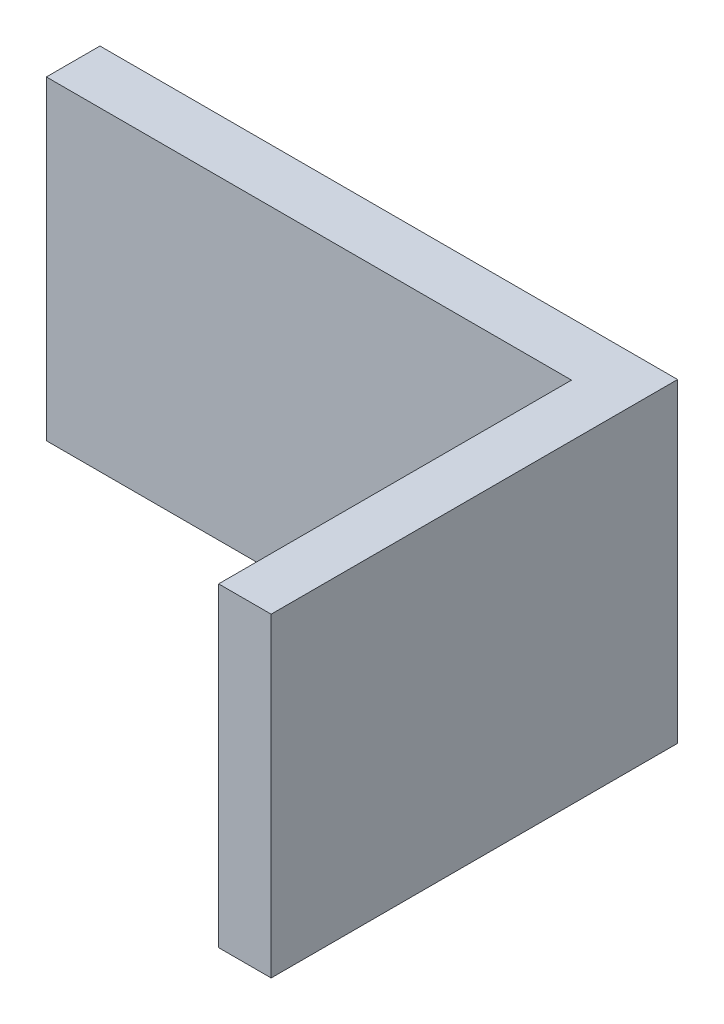
ISO-10303-21;
HEADER;
FILE_DESCRIPTION(('STEP AP214'),'2;1');
FILE_NAME('part.step','',(''),(''),'','','');
FILE_SCHEMA(('AUTOMOTIVE_DESIGN { 1 0 10303 214 1 1 1 1 }'));
ENDSEC;
DATA;
#1=APPLICATION_CONTEXT('core data for automotive mechanical design processes');
#2=APPLICATION_PROTOCOL_DEFINITION('international standard','automotive_design',2000,#1);
#3=PRODUCT_CONTEXT('',#1,'mechanical');
#4=PRODUCT('Part','Part','',(#3));
#5=PRODUCT_RELATED_PRODUCT_CATEGORY('part','',(#4));
#6=PRODUCT_DEFINITION_FORMATION('','',#4);
#7=PRODUCT_DEFINITION_CONTEXT('part definition',#1,'design');
#8=PRODUCT_DEFINITION('design','',#6,#7);
#9=PRODUCT_DEFINITION_SHAPE('','',#8);
#10=(LENGTH_UNIT() NAMED_UNIT(*) SI_UNIT(.MILLI.,.METRE.));
#11=(NAMED_UNIT(*) PLANE_ANGLE_UNIT() SI_UNIT($,.RADIAN.));
#12=(NAMED_UNIT(*) SI_UNIT($,.STERADIAN.) SOLID_ANGLE_UNIT());
#13=UNCERTAINTY_MEASURE_WITH_UNIT(LENGTH_MEASURE(1.E-05),#10,'distance_accuracy_value','');
#14=(GEOMETRIC_REPRESENTATION_CONTEXT(3) GLOBAL_UNCERTAINTY_ASSIGNED_CONTEXT((#13)) GLOBAL_UNIT_ASSIGNED_CONTEXT((#10,
#11,#12)) REPRESENTATION_CONTEXT('',''));
#15=CARTESIAN_POINT('',(0.,0.,0.));
#16=DIRECTION('',(0.,0.,1.));
#17=DIRECTION('',(1.,0.,0.));
#18=AXIS2_PLACEMENT_3D('',#15,#16,#17);
#19=CARTESIAN_POINT('',(4.55,2.9,0.));
#20=DIRECTION('',(0.,1.,0.));
#21=DIRECTION('',(0.,0.,1.));
#22=AXIS2_PLACEMENT_3D('',#19,#20,#21);
#23=PLANE('',#22);
#24=DIRECTION('',(1.,0.,0.));
#25=VECTOR('',#24,1.);
#26=CARTESIAN_POINT('',(4.,2.9,0.));
#27=LINE('',#26,#25);
#28=CARTESIAN_POINT('',(4.,2.9,0.));
#29=VERTEX_POINT('',#28);
#30=CARTESIAN_POINT('',(4.55,2.9,0.));
#31=VERTEX_POINT('',#30);
#32=EDGE_CURVE('E11',#29,#31,#27,.T.);
#33=ORIENTED_EDGE('',*,*,#32,.F.);
#34=DIRECTION('',(0.,0.,-1.));
#35=VECTOR('',#34,1.);
#36=CARTESIAN_POINT('',(4.,2.9,0.051));
#37=LINE('',#36,#35);
#38=CARTESIAN_POINT('',(4.,2.9,0.051));
#39=VERTEX_POINT('',#38);
#40=EDGE_CURVE('E24',#39,#29,#37,.T.);
#41=ORIENTED_EDGE('',*,*,#40,.F.);
#42=DIRECTION('',(-1.,0.,0.));
#43=VECTOR('',#42,1.);
#44=CARTESIAN_POINT('',(4.5,2.9,0.051));
#45=LINE('',#44,#43);
#46=CARTESIAN_POINT('',(4.5,2.9,0.051));
#47=VERTEX_POINT('',#46);
#48=EDGE_CURVE('E87',#47,#39,#45,.T.);
#49=ORIENTED_EDGE('',*,*,#48,.F.);
#50=DIRECTION('',(0.,0.,-1.));
#51=VECTOR('',#50,1.);
#52=CARTESIAN_POINT('',(4.5,2.9,0.387));
#53=LINE('',#52,#51);
#54=CARTESIAN_POINT('',(4.5,2.9,0.387));
#55=VERTEX_POINT('',#54);
#56=EDGE_CURVE('E114',#55,#47,#53,.T.);
#57=ORIENTED_EDGE('',*,*,#56,.F.);
#58=DIRECTION('',(-1.,0.,0.));
#59=VECTOR('',#58,1.);
#60=CARTESIAN_POINT('',(4.55,2.9,0.387));
#61=LINE('',#60,#59);
#62=CARTESIAN_POINT('',(4.55,2.9,0.387));
#63=VERTEX_POINT('',#62);
#64=EDGE_CURVE('E111',#63,#55,#61,.T.);
#65=ORIENTED_EDGE('',*,*,#64,.F.);
#66=DIRECTION('',(0.,0.,1.));
#67=VECTOR('',#66,1.);
#68=CARTESIAN_POINT('',(4.55,2.9,0.));
#69=LINE('',#68,#67);
#70=EDGE_CURVE('E108',#31,#63,#69,.T.);
#71=ORIENTED_EDGE('',*,*,#70,.F.);
#72=EDGE_LOOP('',(#33,#41,#49,#57,#65,#71));
#73=FACE_BOUND('',#72,.T.);
#74=ADVANCED_FACE('F17',(#73),#23,.T.);
#75=CARTESIAN_POINT('',(4.,2.6,0.));
#76=DIRECTION('',(0.,-1.,0.));
#77=DIRECTION('',(0.,0.,1.));
#78=AXIS2_PLACEMENT_3D('',#75,#76,#77);
#79=PLANE('',#78);
#80=DIRECTION('',(-1.,0.,0.));
#81=VECTOR('',#80,1.);
#82=CARTESIAN_POINT('',(4.55,2.6,0.));
#83=LINE('',#82,#81);
#84=CARTESIAN_POINT('',(4.55,2.6,0.));
#85=VERTEX_POINT('',#84);
#86=CARTESIAN_POINT('',(4.,2.6,0.));
#87=VERTEX_POINT('',#86);
#88=EDGE_CURVE('E106',#85,#87,#83,.T.);
#89=ORIENTED_EDGE('',*,*,#88,.F.);
#90=DIRECTION('',(0.,0.,-1.));
#91=VECTOR('',#90,1.);
#92=CARTESIAN_POINT('',(4.55,2.6,0.387));
#93=LINE('',#92,#91);
#94=CARTESIAN_POINT('',(4.55,2.6,0.387));
#95=VERTEX_POINT('',#94);
#96=EDGE_CURVE('E103',#95,#85,#93,.T.);
#97=ORIENTED_EDGE('',*,*,#96,.F.);
#98=DIRECTION('',(1.,0.,0.));
#99=VECTOR('',#98,1.);
#100=CARTESIAN_POINT('',(4.5,2.6,0.387));
#101=LINE('',#100,#99);
#102=CARTESIAN_POINT('',(4.5,2.6,0.387));
#103=VERTEX_POINT('',#102);
#104=EDGE_CURVE('E100',#103,#95,#101,.T.);
#105=ORIENTED_EDGE('',*,*,#104,.F.);
#106=DIRECTION('',(0.,0.,1.));
#107=VECTOR('',#106,1.);
#108=CARTESIAN_POINT('',(4.5,2.6,0.051));
#109=LINE('',#108,#107);
#110=CARTESIAN_POINT('',(4.5,2.6,0.051));
#111=VERTEX_POINT('',#110);
#112=EDGE_CURVE('E72',#111,#103,#109,.T.);
#113=ORIENTED_EDGE('',*,*,#112,.F.);
#114=DIRECTION('',(1.,0.,0.));
#115=VECTOR('',#114,1.);
#116=CARTESIAN_POINT('',(4.,2.6,0.051));
#117=LINE('',#116,#115);
#118=CARTESIAN_POINT('',(4.,2.6,0.051));
#119=VERTEX_POINT('',#118);
#120=EDGE_CURVE('E66',#119,#111,#117,.T.);
#121=ORIENTED_EDGE('',*,*,#120,.F.);
#122=DIRECTION('',(0.,0.,1.));
#123=VECTOR('',#122,1.);
#124=CARTESIAN_POINT('',(4.,2.6,0.));
#125=LINE('',#124,#123);
#126=EDGE_CURVE('E69',#87,#119,#125,.T.);
#127=ORIENTED_EDGE('',*,*,#126,.F.);
#128=EDGE_LOOP('',(#89,#97,#105,#113,#121,#127));
#129=FACE_BOUND('',#128,.T.);
#130=ADVANCED_FACE('F68',(#129),#79,.T.);
#131=CARTESIAN_POINT('',(4.55,2.9,0.387));
#132=DIRECTION('',(0.,0.,1.));
#133=DIRECTION('',(0.,1.,0.));
#134=AXIS2_PLACEMENT_3D('',#131,#132,#133);
#135=PLANE('',#134);
#136=ORIENTED_EDGE('',*,*,#64,.T.);
#137=DIRECTION('',(0.,1.,0.));
#138=VECTOR('',#137,1.);
#139=CARTESIAN_POINT('',(4.5,2.6,0.387));
#140=LINE('',#139,#138);
#141=EDGE_CURVE('E83',#103,#55,#140,.T.);
#142=ORIENTED_EDGE('',*,*,#141,.F.);
#143=ORIENTED_EDGE('',*,*,#104,.T.);
#144=DIRECTION('',(0.,-1.,0.));
#145=VECTOR('',#144,1.);
#146=CARTESIAN_POINT('',(4.55,2.9,0.387));
#147=LINE('',#146,#145);
#148=EDGE_CURVE('E88',#63,#95,#147,.T.);
#149=ORIENTED_EDGE('',*,*,#148,.F.);
#150=EDGE_LOOP('',(#136,#142,#143,#149));
#151=FACE_BOUND('',#150,.T.);
#152=ADVANCED_FACE('F125',(#151),#135,.T.);
#153=CARTESIAN_POINT('',(4.5,2.9,0.051));
#154=DIRECTION('',(0.,0.,1.));
#155=DIRECTION('',(0.,1.,0.));
#156=AXIS2_PLACEMENT_3D('',#153,#154,#155);
#157=PLANE('',#156);
#158=ORIENTED_EDGE('',*,*,#48,.T.);
#159=DIRECTION('',(0.,1.,0.));
#160=VECTOR('',#159,1.);
#161=CARTESIAN_POINT('',(4.,2.6,0.051));
#162=LINE('',#161,#160);
#163=EDGE_CURVE('E81',#119,#39,#162,.T.);
#164=ORIENTED_EDGE('',*,*,#163,.F.);
#165=ORIENTED_EDGE('',*,*,#120,.T.);
#166=DIRECTION('',(0.,-1.,0.));
#167=VECTOR('',#166,1.);
#168=CARTESIAN_POINT('',(4.5,2.9,0.051));
#169=LINE('',#168,#167);
#170=EDGE_CURVE('E89',#47,#111,#169,.T.);
#171=ORIENTED_EDGE('',*,*,#170,.F.);
#172=EDGE_LOOP('',(#158,#164,#165,#171));
#173=FACE_BOUND('',#172,.T.);
#174=ADVANCED_FACE('F86',(#173),#157,.T.);
#175=CARTESIAN_POINT('',(4.55,2.6,0.));
#176=DIRECTION('',(1.,0.,0.));
#177=DIRECTION('',(0.,0.,1.));
#178=AXIS2_PLACEMENT_3D('',#175,#176,#177);
#179=PLANE('',#178);
#180=DIRECTION('',(0.,-1.,0.));
#181=VECTOR('',#180,1.);
#182=CARTESIAN_POINT('',(4.55,2.9,0.));
#183=LINE('',#182,#181);
#184=EDGE_CURVE('E93',#31,#85,#183,.T.);
#185=ORIENTED_EDGE('',*,*,#184,.F.);
#186=ORIENTED_EDGE('',*,*,#70,.T.);
#187=ORIENTED_EDGE('',*,*,#148,.T.);
#188=ORIENTED_EDGE('',*,*,#96,.T.);
#189=EDGE_LOOP('',(#185,#186,#187,#188));
#190=FACE_BOUND('',#189,.T.);
#191=ADVANCED_FACE('F121',(#190),#179,.T.);
#192=CARTESIAN_POINT('',(4.,2.9,0.));
#193=DIRECTION('',(-1.,0.,0.));
#194=DIRECTION('',(0.,0.,1.));
#195=AXIS2_PLACEMENT_3D('',#192,#193,#194);
#196=PLANE('',#195);
#197=DIRECTION('',(0.,1.,0.));
#198=VECTOR('',#197,1.);
#199=CARTESIAN_POINT('',(4.,2.6,0.));
#200=LINE('',#199,#198);
#201=EDGE_CURVE('E82',#87,#29,#200,.T.);
#202=ORIENTED_EDGE('',*,*,#201,.F.);
#203=ORIENTED_EDGE('',*,*,#126,.T.);
#204=ORIENTED_EDGE('',*,*,#163,.T.);
#205=ORIENTED_EDGE('',*,*,#40,.T.);
#206=EDGE_LOOP('',(#202,#203,#204,#205));
#207=FACE_BOUND('',#206,.T.);
#208=ADVANCED_FACE('F80',(#207),#196,.T.);
#209=CARTESIAN_POINT('',(4.5,2.9,0.051));
#210=DIRECTION('',(-1.,0.,0.));
#211=DIRECTION('',(0.,0.,1.));
#212=AXIS2_PLACEMENT_3D('',#209,#210,#211);
#213=PLANE('',#212);
#214=ORIENTED_EDGE('',*,*,#170,.T.);
#215=ORIENTED_EDGE('',*,*,#112,.T.);
#216=ORIENTED_EDGE('',*,*,#141,.T.);
#217=ORIENTED_EDGE('',*,*,#56,.T.);
#218=EDGE_LOOP('',(#214,#215,#216,#217));
#219=FACE_BOUND('',#218,.T.);
#220=ADVANCED_FACE('F127',(#219),#213,.T.);
#221=CARTESIAN_POINT('',(4.55,2.6,0.));
#222=DIRECTION('',(0.,0.,-1.));
#223=DIRECTION('',(0.,1.,0.));
#224=AXIS2_PLACEMENT_3D('',#221,#222,#223);
#225=PLANE('',#224);
#226=ORIENTED_EDGE('',*,*,#88,.T.);
#227=ORIENTED_EDGE('',*,*,#201,.T.);
#228=ORIENTED_EDGE('',*,*,#32,.T.);
#229=ORIENTED_EDGE('',*,*,#184,.T.);
#230=EDGE_LOOP('',(#226,#227,#228,#229));
#231=FACE_BOUND('',#230,.T.);
#232=ADVANCED_FACE('F117',(#231),#225,.T.);
#233=CLOSED_SHELL('',(#74,#130,#152,#174,#191,#208,#220,#232));
#234=MANIFOLD_SOLID_BREP('B1',#233);
#235=ADVANCED_BREP_SHAPE_REPRESENTATION('',(#18,#234),#14);
#236=SHAPE_DEFINITION_REPRESENTATION(#9,#235);
ENDSEC;
END-ISO-10303-21;
